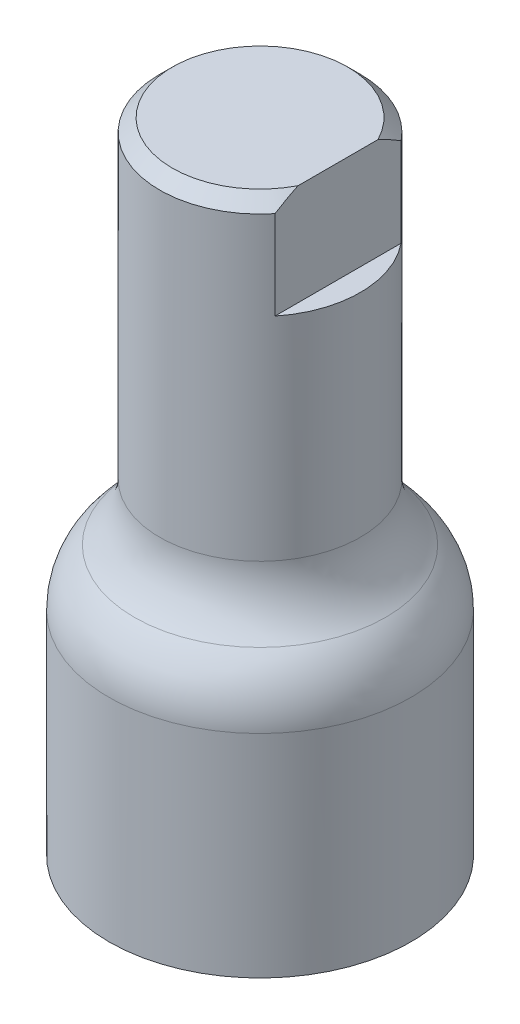
ISO-10303-21;
HEADER;
FILE_DESCRIPTION(('STEP AP214'),'2;1');
FILE_NAME('part.step','',(''),(''),'','','');
FILE_SCHEMA(('AUTOMOTIVE_DESIGN { 1 0 10303 214 1 1 1 1 }'));
ENDSEC;
DATA;
#1=APPLICATION_CONTEXT('core data for automotive mechanical design processes');
#2=APPLICATION_PROTOCOL_DEFINITION('international standard','automotive_design',2000,#1);
#3=PRODUCT_CONTEXT('',#1,'mechanical');
#4=PRODUCT('Part','Part','',(#3));
#5=PRODUCT_RELATED_PRODUCT_CATEGORY('part','',(#4));
#6=PRODUCT_DEFINITION_FORMATION('','',#4);
#7=PRODUCT_DEFINITION_CONTEXT('part definition',#1,'design');
#8=PRODUCT_DEFINITION('design','',#6,#7);
#9=PRODUCT_DEFINITION_SHAPE('','',#8);
#10=(LENGTH_UNIT() NAMED_UNIT(*) SI_UNIT(.MILLI.,.METRE.));
#11=(NAMED_UNIT(*) PLANE_ANGLE_UNIT() SI_UNIT($,.RADIAN.));
#12=(NAMED_UNIT(*) SI_UNIT($,.STERADIAN.) SOLID_ANGLE_UNIT());
#13=UNCERTAINTY_MEASURE_WITH_UNIT(LENGTH_MEASURE(1.E-05),#10,'distance_accuracy_value','');
#14=(GEOMETRIC_REPRESENTATION_CONTEXT(3) GLOBAL_UNCERTAINTY_ASSIGNED_CONTEXT((#13)) GLOBAL_UNIT_ASSIGNED_CONTEXT((#10,
#11,#12)) REPRESENTATION_CONTEXT('',''));
#15=CARTESIAN_POINT('',(0.,0.,0.));
#16=DIRECTION('',(0.,0.,1.));
#17=DIRECTION('',(1.,0.,0.));
#18=AXIS2_PLACEMENT_3D('',#15,#16,#17);
#19=CARTESIAN_POINT('',(0.,40.,0.));
#20=DIRECTION('',(0.,-1.,0.));
#21=DIRECTION('',(0.,0.,-1.));
#22=AXIS2_PLACEMENT_3D('',#19,#20,#21);
#23=CYLINDRICAL_SURFACE('',#22,6.2865);
#24=CARTESIAN_POINT('',(0.,20.3651280605346,0.));
#25=DIRECTION('',(0.,-1.,0.));
#26=DIRECTION('',(0.,0.,-1.));
#27=AXIS2_PLACEMENT_3D('',#24,#25,#26);
#28=CIRCLE('',#27,6.2865);
#29=CARTESIAN_POINT('',(0.,20.3651280605346,-6.2865));
#30=VERTEX_POINT('',#29);
#31=EDGE_CURVE('E92',#30,#30,#28,.F.);
#32=ORIENTED_EDGE('',*,*,#31,.T.);
#33=EDGE_LOOP('',(#32));
#34=FACE_BOUND('',#33,.T.);
#35=DIRECTION('',(0.,1.,0.));
#36=VECTOR('',#35,1.);
#37=CARTESIAN_POINT('',(4.8895,33.65,3.95131269327043));
#38=LINE('',#37,#36);
#39=CARTESIAN_POINT('',(4.8895,33.65,3.95131269327043));
#40=VERTEX_POINT('',#39);
#41=CARTESIAN_POINT('',(4.8895,39.20625,3.95131269327043));
#42=VERTEX_POINT('',#41);
#43=EDGE_CURVE('E71',#40,#42,#38,.T.);
#44=ORIENTED_EDGE('',*,*,#43,.T.);
#45=CARTESIAN_POINT('',(0.,39.20625,0.));
#46=DIRECTION('',(0.,1.,0.));
#47=DIRECTION('',(0.,0.,1.));
#48=AXIS2_PLACEMENT_3D('',#45,#46,#47);
#49=CIRCLE('',#48,6.2865);
#50=CARTESIAN_POINT('',(4.8895,39.20625,-3.95131269327043));
#51=VERTEX_POINT('',#50);
#52=EDGE_CURVE('E11',#42,#51,#49,.F.);
#53=ORIENTED_EDGE('',*,*,#52,.T.);
#54=DIRECTION('',(0.,1.,0.));
#55=VECTOR('',#54,1.);
#56=CARTESIAN_POINT('',(4.8895,33.65,-3.95131269327043));
#57=LINE('',#56,#55);
#58=CARTESIAN_POINT('',(4.8895,33.65,-3.95131269327043));
#59=VERTEX_POINT('',#58);
#60=EDGE_CURVE('E69',#59,#51,#57,.T.);
#61=ORIENTED_EDGE('',*,*,#60,.F.);
#62=CARTESIAN_POINT('',(0.,33.65,0.));
#63=DIRECTION('',(0.,1.,0.));
#64=DIRECTION('',(0.,0.,1.));
#65=AXIS2_PLACEMENT_3D('',#62,#63,#64);
#66=CIRCLE('',#65,6.2865);
#67=EDGE_CURVE('E74',#40,#59,#66,.T.);
#68=ORIENTED_EDGE('',*,*,#67,.F.);
#69=EDGE_LOOP('',(#44,#53,#61,#68));
#70=FACE_BOUND('',#69,.T.);
#71=ADVANCED_FACE('F34',(#34,#70),#23,.T.);
#72=CARTESIAN_POINT('',(0.,40.,0.));
#73=DIRECTION('',(0.,1.,0.));
#74=DIRECTION('',(0.,0.,1.));
#75=AXIS2_PLACEMENT_3D('',#72,#73,#74);
#76=PLANE('',#75);
#77=DIRECTION('',(0.,0.,-1.));
#78=VECTOR('',#77,1.);
#79=CARTESIAN_POINT('',(4.8895,40.,3.95131269327043));
#80=LINE('',#79,#78);
#81=CARTESIAN_POINT('',(4.8895,40.,2.50261709266517));
#82=VERTEX_POINT('',#81);
#83=CARTESIAN_POINT('',(4.8895,40.,-2.50261709266517));
#84=VERTEX_POINT('',#83);
#85=EDGE_CURVE('E77',#82,#84,#80,.T.);
#86=ORIENTED_EDGE('',*,*,#85,.T.);
#87=CARTESIAN_POINT('',(0.,40.,0.));
#88=DIRECTION('',(0.,1.,0.));
#89=DIRECTION('',(0.,0.,1.));
#90=AXIS2_PLACEMENT_3D('',#87,#88,#89);
#91=CIRCLE('',#90,5.49274999999999);
#92=EDGE_CURVE('E102',#84,#82,#91,.T.);
#93=ORIENTED_EDGE('',*,*,#92,.T.);
#94=EDGE_LOOP('',(#86,#93));
#95=FACE_BOUND('',#94,.T.);
#96=ADVANCED_FACE('F132',(#95),#76,.T.);
#97=CARTESIAN_POINT('',(0.,15.875,0.));
#98=DIRECTION('',(0.,-1.,0.));
#99=DIRECTION('',(0.,0.,-1.));
#100=AXIS2_PLACEMENT_3D('',#97,#98,#99);
#101=CYLINDRICAL_SURFACE('',#100,9.4615);
#102=CARTESIAN_POINT('',(0.,13.2656122319727,0.));
#103=DIRECTION('',(0.,-1.,0.));
#104=DIRECTION('',(0.,0.,-1.));
#105=AXIS2_PLACEMENT_3D('',#102,#103,#104);
#106=CIRCLE('',#105,9.4615);
#107=CARTESIAN_POINT('',(0.,13.2656122319727,-9.4615));
#108=VERTEX_POINT('',#107);
#109=EDGE_CURVE('E98',#108,#108,#106,.T.);
#110=ORIENTED_EDGE('',*,*,#109,.T.);
#111=EDGE_LOOP('',(#110));
#112=FACE_BOUND('',#111,.T.);
#113=CARTESIAN_POINT('',(0.,0.,0.));
#114=DIRECTION('',(0.,1.,0.));
#115=DIRECTION('',(0.,0.,1.));
#116=AXIS2_PLACEMENT_3D('',#113,#114,#115);
#117=CIRCLE('',#116,9.4615);
#118=CARTESIAN_POINT('',(0.,0.,9.4615));
#119=VERTEX_POINT('',#118);
#120=EDGE_CURVE('E87',#119,#119,#117,.T.);
#121=ORIENTED_EDGE('',*,*,#120,.T.);
#122=EDGE_LOOP('',(#121));
#123=FACE_BOUND('',#122,.T.);
#124=ADVANCED_FACE('F129',(#112,#123),#101,.T.);
#125=CARTESIAN_POINT('',(0.,0.,0.));
#126=DIRECTION('',(0.,1.,0.));
#127=DIRECTION('',(0.,0.,1.));
#128=AXIS2_PLACEMENT_3D('',#125,#126,#127);
#129=PLANE('',#128);
#130=CARTESIAN_POINT('',(0.,0.,0.));
#131=DIRECTION('',(0.,1.,0.));
#132=DIRECTION('',(0.,0.,1.));
#133=AXIS2_PLACEMENT_3D('',#130,#131,#132);
#134=CIRCLE('',#133,6.35);
#135=CARTESIAN_POINT('',(0.,0.,6.35));
#136=VERTEX_POINT('',#135);
#137=EDGE_CURVE('E80',#136,#136,#134,.T.);
#138=ORIENTED_EDGE('',*,*,#137,.T.);
#139=EDGE_LOOP('',(#138));
#140=FACE_BOUND('',#139,.T.);
#141=ORIENTED_EDGE('',*,*,#120,.F.);
#142=EDGE_LOOP('',(#141));
#143=FACE_BOUND('',#142,.T.);
#144=ADVANCED_FACE('F127',(#140,#143),#129,.F.);
#145=CARTESIAN_POINT('',(0.,12.7,0.));
#146=DIRECTION('',(0.,-1.,0.));
#147=DIRECTION('',(0.,0.,-1.));
#148=AXIS2_PLACEMENT_3D('',#145,#146,#147);
#149=CYLINDRICAL_SURFACE('',#148,6.35);
#150=CARTESIAN_POINT('',(0.,12.7,0.));
#151=DIRECTION('',(0.,1.,0.));
#152=DIRECTION('',(0.,0.,1.));
#153=AXIS2_PLACEMENT_3D('',#150,#151,#152);
#154=CIRCLE('',#153,6.35);
#155=CARTESIAN_POINT('',(0.,12.7,6.35));
#156=VERTEX_POINT('',#155);
#157=EDGE_CURVE('E84',#156,#156,#154,.T.);
#158=ORIENTED_EDGE('',*,*,#157,.T.);
#159=EDGE_LOOP('',(#158));
#160=FACE_BOUND('',#159,.T.);
#161=ORIENTED_EDGE('',*,*,#137,.F.);
#162=EDGE_LOOP('',(#161));
#163=FACE_BOUND('',#162,.T.);
#164=ADVANCED_FACE('F123',(#160,#163),#149,.F.);
#165=CARTESIAN_POINT('',(0.,12.7,0.));
#166=DIRECTION('',(0.,1.,0.));
#167=DIRECTION('',(0.,0.,1.));
#168=AXIS2_PLACEMENT_3D('',#165,#166,#167);
#169=PLANE('',#168);
#170=ORIENTED_EDGE('',*,*,#157,.F.);
#171=EDGE_LOOP('',(#170));
#172=FACE_BOUND('',#171,.T.);
#173=ADVANCED_FACE('F118',(#172),#169,.F.);
#174=CARTESIAN_POINT('',(0.,20.3651280605346,0.));
#175=DIRECTION('',(0.,-1.,0.));
#176=DIRECTION('',(0.,0.,-1.));
#177=AXIS2_PLACEMENT_3D('',#174,#175,#176);
#178=TOROIDAL_SURFACE('',#177,11.049,4.7625);
#179=CARTESIAN_POINT('',(0.,16.8153701462537,0.));
#180=DIRECTION('',(0.,1.,0.));
#181=DIRECTION('',(0.,0.,1.));
#182=AXIS2_PLACEMENT_3D('',#179,#180,#181);
#183=CIRCLE('',#182,7.874);
#184=CARTESIAN_POINT('',(0.,16.8153701462537,7.874));
#185=VERTEX_POINT('',#184);
#186=EDGE_CURVE('E95',#185,#185,#183,.T.);
#187=ORIENTED_EDGE('',*,*,#186,.T.);
#188=EDGE_LOOP('',(#187));
#189=FACE_BOUND('',#188,.T.);
#190=ORIENTED_EDGE('',*,*,#31,.F.);
#191=EDGE_LOOP('',(#190));
#192=FACE_BOUND('',#191,.T.);
#193=ADVANCED_FACE('F122',(#189,#192),#178,.F.);
#194=CARTESIAN_POINT('',(0.,13.2656122319727,0.));
#195=DIRECTION('',(0.,-1.,0.));
#196=DIRECTION('',(0.,0.,-1.));
#197=AXIS2_PLACEMENT_3D('',#194,#195,#196);
#198=DEGENERATE_TOROIDAL_SURFACE('',#197,4.699,4.7625,.T.);
#199=ORIENTED_EDGE('',*,*,#109,.F.);
#200=EDGE_LOOP('',(#199));
#201=FACE_BOUND('',#200,.T.);
#202=ORIENTED_EDGE('',*,*,#186,.F.);
#203=EDGE_LOOP('',(#202));
#204=FACE_BOUND('',#203,.T.);
#205=ADVANCED_FACE('F117',(#201,#204),#198,.T.);
#206=CARTESIAN_POINT('',(4.8895,33.65,3.95131269327043));
#207=DIRECTION('',(1.,0.,0.));
#208=DIRECTION('',(0.,0.,-1.));
#209=AXIS2_PLACEMENT_3D('',#206,#207,#208);
#210=PLANE('',#209);
#211=ORIENTED_EDGE('',*,*,#85,.F.);
#212=CARTESIAN_POINT('',(4.8895,40.,2.50261709266517));
#213=CARTESIAN_POINT('',(4.8895,39.9428169864129,2.62807233363838));
#214=CARTESIAN_POINT('',(4.8895,39.8828658388279,2.75222812932706));
#215=CARTESIAN_POINT('',(4.8895,39.7582936489579,2.9980084333871));
#216=CARTESIAN_POINT('',(4.8895,39.6936778207006,3.11963557811033));
#217=CARTESIAN_POINT('',(4.8895,39.5605287906818,3.36067333211539));
#218=CARTESIAN_POINT('',(4.8895,39.4919965088834,3.48008445327511));
#219=CARTESIAN_POINT('',(4.8895,39.351519404013,3.7170633465092));
#220=CARTESIAN_POINT('',(4.8895,39.2795709081006,3.83462894514068));
#221=CARTESIAN_POINT('',(4.8895,39.20625,3.95131269327043));
#222=B_SPLINE_CURVE_WITH_KNOTS('',3,(#212,#213,#214,#215,#216,#217,#218,#219,#220,#221),
.UNSPECIFIED.,.F.,.F.,(4,2,2,2,4),(0.,0.413535374650093,0.826615464012299,1.23959891780472,
1.6530369027104),.UNSPECIFIED.);
#223=EDGE_CURVE('E43',#82,#42,#222,.T.);
#224=ORIENTED_EDGE('',*,*,#223,.T.);
#225=ORIENTED_EDGE('',*,*,#43,.F.);
#226=DIRECTION('',(0.,0.,-1.));
#227=VECTOR('',#226,1.);
#228=CARTESIAN_POINT('',(4.8895,33.65,3.95131269327043));
#229=LINE('',#228,#227);
#230=EDGE_CURVE('E66',#40,#59,#229,.T.);
#231=ORIENTED_EDGE('',*,*,#230,.T.);
#232=ORIENTED_EDGE('',*,*,#60,.T.);
#233=CARTESIAN_POINT('',(4.8895,39.20625,-3.95131269327043));
#234=CARTESIAN_POINT('',(4.8895,39.2795709081006,-3.83462894514068));
#235=CARTESIAN_POINT('',(4.8895,39.351519404013,-3.7170633465092));
#236=CARTESIAN_POINT('',(4.8895,39.4919965088834,-3.48008445327511));
#237=CARTESIAN_POINT('',(4.8895,39.5605287906818,-3.36067333211539));
#238=CARTESIAN_POINT('',(4.8895,39.6936778207006,-3.11963557811033));
#239=CARTESIAN_POINT('',(4.8895,39.7582936489579,-2.9980084333871));
#240=CARTESIAN_POINT('',(4.8895,39.8828658388279,-2.75222812932706));
#241=CARTESIAN_POINT('',(4.8895,39.9428169864129,-2.62807233363838));
#242=CARTESIAN_POINT('',(4.8895,40.,-2.50261709266517));
#243=B_SPLINE_CURVE_WITH_KNOTS('',3,(#233,#234,#235,#236,#237,#238,#239,#240,#241,#242),
.UNSPECIFIED.,.F.,.F.,(4,2,2,2,4),(0.,0.41343798490568,0.826421438698102,1.23950152806031,
1.6530369027104),.UNSPECIFIED.);
#244=EDGE_CURVE('E105',#51,#84,#243,.T.);
#245=ORIENTED_EDGE('',*,*,#244,.T.);
#246=EDGE_LOOP('',(#211,#224,#225,#231,#232,#245));
#247=FACE_BOUND('',#246,.T.);
#248=ADVANCED_FACE('F68',(#247),#210,.T.);
#249=CARTESIAN_POINT('',(0.,33.65,0.));
#250=DIRECTION('',(0.,1.,0.));
#251=DIRECTION('',(0.,0.,1.));
#252=AXIS2_PLACEMENT_3D('',#249,#250,#251);
#253=PLANE('',#252);
#254=ORIENTED_EDGE('',*,*,#67,.T.);
#255=ORIENTED_EDGE('',*,*,#230,.F.);
#256=EDGE_LOOP('',(#254,#255));
#257=FACE_BOUND('',#256,.T.);
#258=ADVANCED_FACE('F76',(#257),#253,.T.);
#259=CARTESIAN_POINT('',(0.,40.,0.));
#260=DIRECTION('',(0.,-1.,0.));
#261=DIRECTION('',(0.,0.,-1.));
#262=AXIS2_PLACEMENT_3D('',#259,#260,#261);
#263=CONICAL_SURFACE('',#262,5.49274999999999,0.785398163397455);
#264=ORIENTED_EDGE('',*,*,#244,.F.);
#265=ORIENTED_EDGE('',*,*,#52,.F.);
#266=ORIENTED_EDGE('',*,*,#223,.F.);
#267=ORIENTED_EDGE('',*,*,#92,.F.);
#268=EDGE_LOOP('',(#264,#265,#266,#267));
#269=FACE_BOUND('',#268,.T.);
#270=ADVANCED_FACE('F36',(#269),#263,.T.);
#271=CLOSED_SHELL('',(#71,#96,#124,#144,#164,#173,#193,#205,#248,#258,#270));
#272=MANIFOLD_SOLID_BREP('B2',#271);
#273=ADVANCED_BREP_SHAPE_REPRESENTATION('',(#18,#272),#14);
#274=SHAPE_DEFINITION_REPRESENTATION(#9,#273);
ENDSEC;
END-ISO-10303-21;
